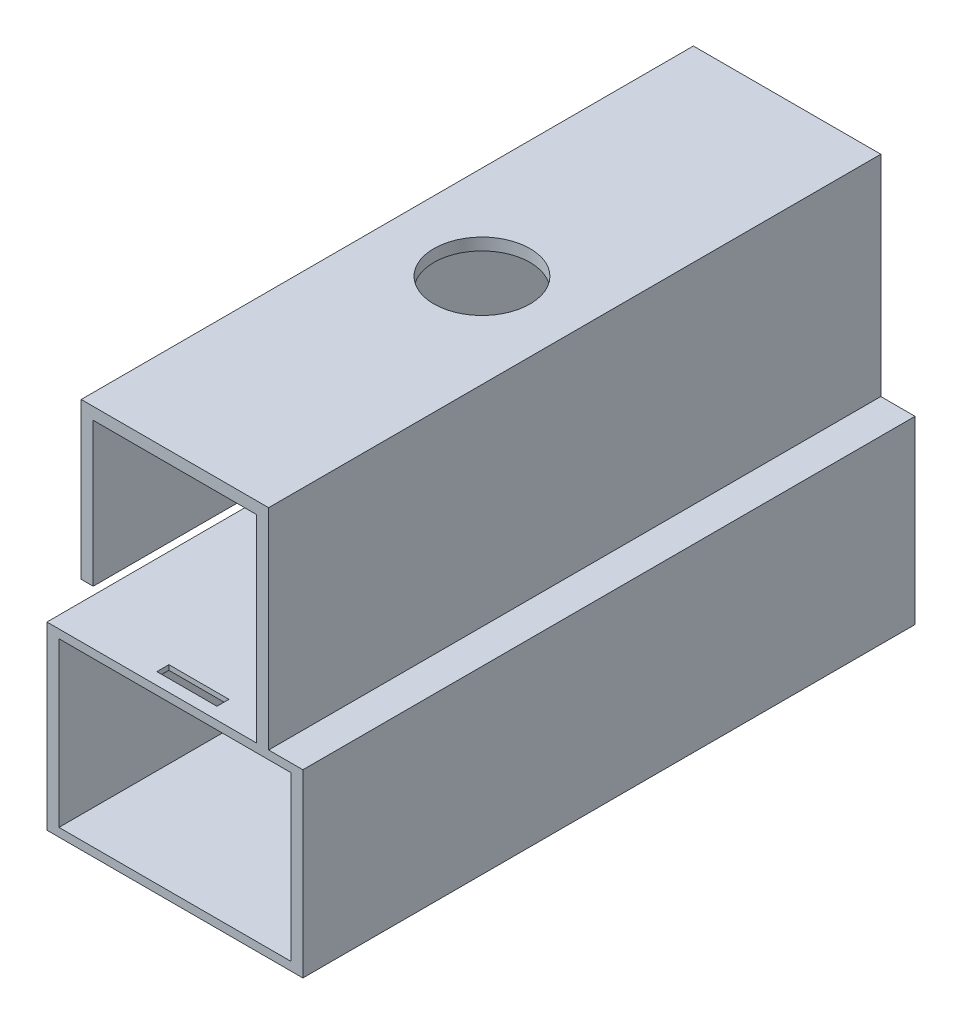
ISO-10303-21;
HEADER;
FILE_DESCRIPTION(('STEP AP214'),'2;1');
FILE_NAME('part.step','',(''),(''),'','','');
FILE_SCHEMA(('AUTOMOTIVE_DESIGN { 1 0 10303 214 1 1 1 1 }'));
ENDSEC;
DATA;
#1=APPLICATION_CONTEXT('core data for automotive mechanical design processes');
#2=APPLICATION_PROTOCOL_DEFINITION('international standard','automotive_design',2000,#1);
#3=PRODUCT_CONTEXT('',#1,'mechanical');
#4=PRODUCT('Part','Part','',(#3));
#5=PRODUCT_RELATED_PRODUCT_CATEGORY('part','',(#4));
#6=PRODUCT_DEFINITION_FORMATION('','',#4);
#7=PRODUCT_DEFINITION_CONTEXT('part definition',#1,'design');
#8=PRODUCT_DEFINITION('design','',#6,#7);
#9=PRODUCT_DEFINITION_SHAPE('','',#8);
#10=(LENGTH_UNIT() NAMED_UNIT(*) SI_UNIT(.MILLI.,.METRE.));
#11=(NAMED_UNIT(*) PLANE_ANGLE_UNIT() SI_UNIT($,.RADIAN.));
#12=(NAMED_UNIT(*) SI_UNIT($,.STERADIAN.) SOLID_ANGLE_UNIT());
#13=UNCERTAINTY_MEASURE_WITH_UNIT(LENGTH_MEASURE(1.E-05),#10,'distance_accuracy_value','');
#14=(GEOMETRIC_REPRESENTATION_CONTEXT(3) GLOBAL_UNCERTAINTY_ASSIGNED_CONTEXT((#13)) GLOBAL_UNIT_ASSIGNED_CONTEXT((#10,
#11,#12)) REPRESENTATION_CONTEXT('',''));
#15=CARTESIAN_POINT('',(0.,0.,0.));
#16=DIRECTION('',(0.,0.,1.));
#17=DIRECTION('',(1.,0.,0.));
#18=AXIS2_PLACEMENT_3D('',#15,#16,#17);
#19=CARTESIAN_POINT('',(-5.,49.9403264248705,97.9));
#20=DIRECTION('',(-1.,0.,0.));
#21=DIRECTION('',(0.,0.,1.));
#22=AXIS2_PLACEMENT_3D('',#19,#20,#21);
#23=PLANE('',#22);
#24=DIRECTION('',(0.,0.,-1.));
#25=VECTOR('',#24,1.);
#26=CARTESIAN_POINT('',(-5.,14.2,99.9));
#27=LINE('',#26,#25);
#28=CARTESIAN_POINT('',(-5.,14.2,99.9));
#29=VERTEX_POINT('',#28);
#30=CARTESIAN_POINT('',(-5.,14.2,97.9));
#31=VERTEX_POINT('',#30);
#32=EDGE_CURVE('E263',#29,#31,#27,.T.);
#33=ORIENTED_EDGE('',*,*,#32,.T.);
#34=DIRECTION('',(0.,-1.,0.));
#35=VECTOR('',#34,1.);
#36=CARTESIAN_POINT('',(-5.,49.9403264248705,97.9));
#37=LINE('',#36,#35);
#38=CARTESIAN_POINT('',(-5.,15.0093264248705,97.9));
#39=VERTEX_POINT('',#38);
#40=EDGE_CURVE('E294',#39,#31,#37,.T.);
#41=ORIENTED_EDGE('',*,*,#40,.F.);
#42=DIRECTION('',(0.,0.,1.));
#43=VECTOR('',#42,1.);
#44=CARTESIAN_POINT('',(-5.,15.0093264248705,97.9));
#45=LINE('',#44,#43);
#46=CARTESIAN_POINT('',(-5.,15.0093264248705,99.9));
#47=VERTEX_POINT('',#46);
#48=EDGE_CURVE('E303',#39,#47,#45,.T.);
#49=ORIENTED_EDGE('',*,*,#48,.T.);
#50=DIRECTION('',(0.,-1.,0.));
#51=VECTOR('',#50,1.);
#52=CARTESIAN_POINT('',(-5.,49.9403264248705,99.9));
#53=LINE('',#52,#51);
#54=EDGE_CURVE('E313',#47,#29,#53,.T.);
#55=ORIENTED_EDGE('',*,*,#54,.T.);
#56=EDGE_LOOP('',(#33,#41,#49,#55));
#57=FACE_BOUND('',#56,.T.);
#58=ADVANCED_FACE('F35',(#57),#23,.F.);
#59=CARTESIAN_POINT('',(5.,49.9403264248705,99.9));
#60=DIRECTION('',(0.,0.,1.));
#61=DIRECTION('',(1.,0.,0.));
#62=AXIS2_PLACEMENT_3D('',#59,#60,#61);
#63=PLANE('',#62);
#64=DIRECTION('',(-1.,0.,0.));
#65=VECTOR('',#64,1.);
#66=CARTESIAN_POINT('',(5.,14.2,99.9));
#67=LINE('',#66,#65);
#68=CARTESIAN_POINT('',(5.,14.2,99.9));
#69=VERTEX_POINT('',#68);
#70=EDGE_CURVE('E260',#69,#29,#67,.T.);
#71=ORIENTED_EDGE('',*,*,#70,.T.);
#72=ORIENTED_EDGE('',*,*,#54,.F.);
#73=DIRECTION('',(1.,0.,0.));
#74=VECTOR('',#73,1.);
#75=CARTESIAN_POINT('',(5.,15.0093264248705,99.9));
#76=LINE('',#75,#74);
#77=CARTESIAN_POINT('',(5.,15.0093264248705,99.9));
#78=VERTEX_POINT('',#77);
#79=EDGE_CURVE('E307',#47,#78,#76,.T.);
#80=ORIENTED_EDGE('',*,*,#79,.T.);
#81=DIRECTION('',(0.,-1.,0.));
#82=VECTOR('',#81,1.);
#83=CARTESIAN_POINT('',(5.,49.9403264248705,99.9));
#84=LINE('',#83,#82);
#85=EDGE_CURVE('E316',#78,#69,#84,.T.);
#86=ORIENTED_EDGE('',*,*,#85,.T.);
#87=EDGE_LOOP('',(#71,#72,#80,#86));
#88=FACE_BOUND('',#87,.T.);
#89=ADVANCED_FACE('F535',(#88),#63,.F.);
#90=CARTESIAN_POINT('',(5.,49.9403264248705,97.9));
#91=DIRECTION('',(1.,0.,0.));
#92=DIRECTION('',(0.,0.,-1.));
#93=AXIS2_PLACEMENT_3D('',#90,#91,#92);
#94=PLANE('',#93);
#95=DIRECTION('',(0.,0.,1.));
#96=VECTOR('',#95,1.);
#97=CARTESIAN_POINT('',(5.,14.2,97.9));
#98=LINE('',#97,#96);
#99=CARTESIAN_POINT('',(5.,14.2,97.9));
#100=VERTEX_POINT('',#99);
#101=EDGE_CURVE('E253',#100,#69,#98,.T.);
#102=ORIENTED_EDGE('',*,*,#101,.T.);
#103=ORIENTED_EDGE('',*,*,#85,.F.);
#104=DIRECTION('',(0.,0.,-1.));
#105=VECTOR('',#104,1.);
#106=CARTESIAN_POINT('',(5.,15.0093264248705,97.9));
#107=LINE('',#106,#105);
#108=CARTESIAN_POINT('',(5.,15.0093264248705,97.9));
#109=VERTEX_POINT('',#108);
#110=EDGE_CURVE('E310',#78,#109,#107,.T.);
#111=ORIENTED_EDGE('',*,*,#110,.T.);
#112=DIRECTION('',(0.,-1.,0.));
#113=VECTOR('',#112,1.);
#114=CARTESIAN_POINT('',(5.,49.9403264248705,97.9));
#115=LINE('',#114,#113);
#116=EDGE_CURVE('E304',#109,#100,#115,.T.);
#117=ORIENTED_EDGE('',*,*,#116,.T.);
#118=EDGE_LOOP('',(#102,#103,#111,#117));
#119=FACE_BOUND('',#118,.T.);
#120=ADVANCED_FACE('F541',(#119),#94,.F.);
#121=CARTESIAN_POINT('',(5.,49.9403264248705,97.9));
#122=DIRECTION('',(0.,0.,-1.));
#123=DIRECTION('',(-1.,0.,0.));
#124=AXIS2_PLACEMENT_3D('',#121,#122,#123);
#125=PLANE('',#124);
#126=DIRECTION('',(1.,0.,0.));
#127=VECTOR('',#126,1.);
#128=CARTESIAN_POINT('',(-5.,14.2,97.9));
#129=LINE('',#128,#127);
#130=EDGE_CURVE('E266',#31,#100,#129,.T.);
#131=ORIENTED_EDGE('',*,*,#130,.T.);
#132=ORIENTED_EDGE('',*,*,#116,.F.);
#133=DIRECTION('',(-1.,0.,0.));
#134=VECTOR('',#133,1.);
#135=CARTESIAN_POINT('',(5.,15.0093264248705,97.9));
#136=LINE('',#135,#134);
#137=EDGE_CURVE('E300',#109,#39,#136,.T.);
#138=ORIENTED_EDGE('',*,*,#137,.T.);
#139=ORIENTED_EDGE('',*,*,#40,.T.);
#140=EDGE_LOOP('',(#131,#132,#138,#139));
#141=FACE_BOUND('',#140,.T.);
#142=ADVANCED_FACE('F532',(#141),#125,.F.);
#143=CARTESIAN_POINT('',(-21.3,15.0093264248705,101.9));
#144=DIRECTION('',(0.,-1.,0.));
#145=DIRECTION('',(0.,0.,-1.));
#146=AXIS2_PLACEMENT_3D('',#143,#144,#145);
#147=PLANE('',#146);
#148=DIRECTION('',(-1.,0.,0.));
#149=VECTOR('',#148,1.);
#150=CARTESIAN_POINT('',(-21.3,15.0093264248705,101.9));
#151=LINE('',#150,#149);
#152=CARTESIAN_POINT('',(13.6,15.0093264248705,101.9));
#153=VERTEX_POINT('',#152);
#154=CARTESIAN_POINT('',(-21.3,15.0093264248705,101.9));
#155=VERTEX_POINT('',#154);
#156=EDGE_CURVE('E446',#153,#155,#151,.T.);
#157=ORIENTED_EDGE('',*,*,#156,.F.);
#158=DIRECTION('',(0.,0.,-1.));
#159=VECTOR('',#158,1.);
#160=CARTESIAN_POINT('',(13.6,15.0093264248705,136.887210520417));
#161=LINE('',#160,#159);
#162=CARTESIAN_POINT('',(13.6,15.0093264248705,12.));
#163=VERTEX_POINT('',#162);
#164=EDGE_CURVE('E341',#153,#163,#161,.T.);
#165=ORIENTED_EDGE('',*,*,#164,.T.);
#166=DIRECTION('',(1.,0.,0.));
#167=VECTOR('',#166,1.);
#168=CARTESIAN_POINT('',(-13.6,15.0093264248705,12.));
#169=LINE('',#168,#167);
#170=CARTESIAN_POINT('',(-13.6,15.0093264248705,12.));
#171=VERTEX_POINT('',#170);
#172=EDGE_CURVE('E404',#171,#163,#169,.T.);
#173=ORIENTED_EDGE('',*,*,#172,.F.);
#174=DIRECTION('',(0.,0.,-1.));
#175=VECTOR('',#174,1.);
#176=CARTESIAN_POINT('',(-13.6,15.0093264248705,136.887210520417));
#177=LINE('',#176,#175);
#178=CARTESIAN_POINT('',(-13.6,15.0093264248705,31.9));
#179=VERTEX_POINT('',#178);
#180=EDGE_CURVE('E352',#179,#171,#177,.T.);
#181=ORIENTED_EDGE('',*,*,#180,.F.);
#182=DIRECTION('',(1.,0.,0.));
#183=VECTOR('',#182,1.);
#184=CARTESIAN_POINT('',(-13.6,15.0093264248705,31.9));
#185=LINE('',#184,#183);
#186=CARTESIAN_POINT('',(-15.6,15.0093264248705,31.9));
#187=VERTEX_POINT('',#186);
#188=EDGE_CURVE('E50',#187,#179,#185,.T.);
#189=ORIENTED_EDGE('',*,*,#188,.F.);
#190=DIRECTION('',(0.,0.,-1.));
#191=VECTOR('',#190,1.);
#192=CARTESIAN_POINT('',(-15.6,15.0093264248705,136.887210520417));
#193=LINE('',#192,#191);
#194=CARTESIAN_POINT('',(-15.6,15.0093264248705,0.));
#195=VERTEX_POINT('',#194);
#196=EDGE_CURVE('E354',#187,#195,#193,.T.);
#197=ORIENTED_EDGE('',*,*,#196,.T.);
#198=DIRECTION('',(-1.,0.,0.));
#199=VECTOR('',#198,1.);
#200=CARTESIAN_POINT('',(-21.3,15.0093264248705,0.));
#201=LINE('',#200,#199);
#202=CARTESIAN_POINT('',(-21.3,15.0093264248705,0.));
#203=VERTEX_POINT('',#202);
#204=EDGE_CURVE('E458',#195,#203,#201,.T.);
#205=ORIENTED_EDGE('',*,*,#204,.T.);
#206=DIRECTION('',(0.,0.,-1.));
#207=VECTOR('',#206,1.);
#208=CARTESIAN_POINT('',(-21.3,15.0093264248705,101.9));
#209=LINE('',#208,#207);
#210=EDGE_CURVE('E43',#155,#203,#209,.T.);
#211=ORIENTED_EDGE('',*,*,#210,.F.);
#212=EDGE_LOOP('',(#157,#165,#173,#181,#189,#197,#205,#211));
#213=FACE_BOUND('',#212,.T.);
#214=ORIENTED_EDGE('',*,*,#79,.F.);
#215=ORIENTED_EDGE('',*,*,#48,.F.);
#216=ORIENTED_EDGE('',*,*,#137,.F.);
#217=ORIENTED_EDGE('',*,*,#110,.F.);
#218=EDGE_LOOP('',(#214,#215,#216,#217));
#219=FACE_BOUND('',#218,.T.);
#220=ADVANCED_FACE('F495',(#213,#219),#147,.F.);
#221=CARTESIAN_POINT('',(21.3,15.0093264248705,0.));
#222=VERTEX_POINT('',#221);
#223=CARTESIAN_POINT('',(15.6,15.0093264248705,0.));
#224=VERTEX_POINT('',#223);
#225=EDGE_CURVE('E459',#222,#224,#201,.T.);
#226=ORIENTED_EDGE('',*,*,#225,.T.);
#227=DIRECTION('',(0.,0.,-1.));
#228=VECTOR('',#227,1.);
#229=CARTESIAN_POINT('',(15.6,15.0093264248705,136.887210520417));
#230=LINE('',#229,#228);
#231=CARTESIAN_POINT('',(15.6,15.0093264248705,101.9));
#232=VERTEX_POINT('',#231);
#233=EDGE_CURVE('E338',#232,#224,#230,.T.);
#234=ORIENTED_EDGE('',*,*,#233,.F.);
#235=CARTESIAN_POINT('',(21.3,15.0093264248705,101.9));
#236=VERTEX_POINT('',#235);
#237=EDGE_CURVE('E448',#236,#232,#151,.T.);
#238=ORIENTED_EDGE('',*,*,#237,.F.);
#239=DIRECTION('',(0.,0.,-1.));
#240=VECTOR('',#239,1.);
#241=CARTESIAN_POINT('',(21.3,15.0093264248705,101.9));
#242=LINE('',#241,#240);
#243=EDGE_CURVE('E11',#236,#222,#242,.T.);
#244=ORIENTED_EDGE('',*,*,#243,.T.);
#245=EDGE_LOOP('',(#226,#234,#238,#244));
#246=FACE_BOUND('',#245,.T.);
#247=ADVANCED_FACE('F525',(#246),#147,.F.);
#248=CARTESIAN_POINT('',(0.,0.,101.9));
#249=DIRECTION('',(0.,0.,1.));
#250=DIRECTION('',(1.,0.,0.));
#251=AXIS2_PLACEMENT_3D('',#248,#249,#250);
#252=PLANE('',#251);
#253=DIRECTION('',(0.,1.,0.));
#254=VECTOR('',#253,1.);
#255=CARTESIAN_POINT('',(13.6,15.0093264248705,101.9));
#256=LINE('',#255,#254);
#257=CARTESIAN_POINT('',(13.6,47.9393264248705,101.9));
#258=VERTEX_POINT('',#257);
#259=EDGE_CURVE('E331',#153,#258,#256,.T.);
#260=ORIENTED_EDGE('',*,*,#259,.F.);
#261=ORIENTED_EDGE('',*,*,#156,.T.);
#262=DIRECTION('',(0.,-1.,0.));
#263=VECTOR('',#262,1.);
#264=CARTESIAN_POINT('',(-21.3,15.0093264248705,101.9));
#265=LINE('',#264,#263);
#266=CARTESIAN_POINT('',(-21.3,-15.0093264248705,101.9));
#267=VERTEX_POINT('',#266);
#268=EDGE_CURVE('E451',#155,#267,#265,.T.);
#269=ORIENTED_EDGE('',*,*,#268,.T.);
#270=DIRECTION('',(1.,0.,0.));
#271=VECTOR('',#270,1.);
#272=CARTESIAN_POINT('',(-21.3,-15.0093264248705,101.9));
#273=LINE('',#272,#271);
#274=CARTESIAN_POINT('',(21.3,-15.0093264248705,101.9));
#275=VERTEX_POINT('',#274);
#276=EDGE_CURVE('E453',#267,#275,#273,.T.);
#277=ORIENTED_EDGE('',*,*,#276,.T.);
#278=DIRECTION('',(0.,1.,0.));
#279=VECTOR('',#278,1.);
#280=CARTESIAN_POINT('',(21.3,15.0093264248705,101.9));
#281=LINE('',#280,#279);
#282=EDGE_CURVE('E443',#275,#236,#281,.T.);
#283=ORIENTED_EDGE('',*,*,#282,.T.);
#284=ORIENTED_EDGE('',*,*,#237,.T.);
#285=DIRECTION('',(0.,-1.,0.));
#286=VECTOR('',#285,1.);
#287=CARTESIAN_POINT('',(15.6,49.9393264248705,101.9));
#288=LINE('',#287,#286);
#289=CARTESIAN_POINT('',(15.6,49.9393264248705,101.9));
#290=VERTEX_POINT('',#289);
#291=EDGE_CURVE('E335',#290,#232,#288,.T.);
#292=ORIENTED_EDGE('',*,*,#291,.F.);
#293=DIRECTION('',(1.,0.,0.));
#294=VECTOR('',#293,1.);
#295=CARTESIAN_POINT('',(-13.6,49.9393264248705,101.9));
#296=LINE('',#295,#294);
#297=CARTESIAN_POINT('',(-15.6,49.9393264248705,101.9));
#298=VERTEX_POINT('',#297);
#299=EDGE_CURVE('E400',#298,#290,#296,.T.);
#300=ORIENTED_EDGE('',*,*,#299,.F.);
#301=DIRECTION('',(0.,1.,0.));
#302=VECTOR('',#301,1.);
#303=CARTESIAN_POINT('',(-15.6,49.9393264248705,101.9));
#304=LINE('',#303,#302);
#305=CARTESIAN_POINT('',(-15.6,24.0093264248705,101.9));
#306=VERTEX_POINT('',#305);
#307=EDGE_CURVE('E348',#306,#298,#304,.T.);
#308=ORIENTED_EDGE('',*,*,#307,.F.);
#309=DIRECTION('',(-1.,0.,0.));
#310=VECTOR('',#309,1.);
#311=CARTESIAN_POINT('',(-15.6,24.0093264248705,101.9));
#312=LINE('',#311,#310);
#313=CARTESIAN_POINT('',(-13.6,24.0093264248705,101.9));
#314=VERTEX_POINT('',#313);
#315=EDGE_CURVE('E246',#314,#306,#312,.T.);
#316=ORIENTED_EDGE('',*,*,#315,.F.);
#317=DIRECTION('',(0.,-1.,0.));
#318=VECTOR('',#317,1.);
#319=CARTESIAN_POINT('',(-13.6,15.0093264248705,101.9));
#320=LINE('',#319,#318);
#321=CARTESIAN_POINT('',(-13.6,47.9393264248705,101.9));
#322=VERTEX_POINT('',#321);
#323=EDGE_CURVE('E251',#322,#314,#320,.T.);
#324=ORIENTED_EDGE('',*,*,#323,.F.);
#325=DIRECTION('',(1.,0.,0.));
#326=VECTOR('',#325,1.);
#327=CARTESIAN_POINT('',(-13.6,47.9393264248705,101.9));
#328=LINE('',#327,#326);
#329=EDGE_CURVE('E398',#322,#258,#328,.T.);
#330=ORIENTED_EDGE('',*,*,#329,.T.);
#331=EDGE_LOOP('',(#260,#261,#269,#277,#283,#284,#292,#300,#308,#316,#324,#330));
#332=FACE_BOUND('',#331,.T.);
#333=DIRECTION('',(-1.,0.,0.));
#334=VECTOR('',#333,1.);
#335=CARTESIAN_POINT('',(-19.3,13.6,101.9));
#336=LINE('',#335,#334);
#337=CARTESIAN_POINT('',(19.3,13.6,101.9));
#338=VERTEX_POINT('',#337);
#339=CARTESIAN_POINT('',(-19.3,13.6,101.9));
#340=VERTEX_POINT('',#339);
#341=EDGE_CURVE('E414',#338,#340,#336,.T.);
#342=ORIENTED_EDGE('',*,*,#341,.F.);
#343=DIRECTION('',(0.,1.,0.));
#344=VECTOR('',#343,1.);
#345=CARTESIAN_POINT('',(19.3,13.6,101.9));
#346=LINE('',#345,#344);
#347=CARTESIAN_POINT('',(19.3,-13.6,101.9));
#348=VERTEX_POINT('',#347);
#349=EDGE_CURVE('E412',#348,#338,#346,.T.);
#350=ORIENTED_EDGE('',*,*,#349,.F.);
#351=DIRECTION('',(1.,0.,0.));
#352=VECTOR('',#351,1.);
#353=CARTESIAN_POINT('',(-19.3,-13.6,101.9));
#354=LINE('',#353,#352);
#355=CARTESIAN_POINT('',(-19.3,-13.6,101.9));
#356=VERTEX_POINT('',#355);
#357=EDGE_CURVE('E420',#356,#348,#354,.T.);
#358=ORIENTED_EDGE('',*,*,#357,.F.);
#359=DIRECTION('',(0.,-1.,0.));
#360=VECTOR('',#359,1.);
#361=CARTESIAN_POINT('',(-19.3,13.6,101.9));
#362=LINE('',#361,#360);
#363=EDGE_CURVE('E417',#340,#356,#362,.T.);
#364=ORIENTED_EDGE('',*,*,#363,.F.);
#365=EDGE_LOOP('',(#342,#350,#358,#364));
#366=FACE_BOUND('',#365,.T.);
#367=ADVANCED_FACE('F491',(#332,#366),#252,.T.);
#368=CARTESIAN_POINT('',(0.,0.,0.));
#369=DIRECTION('',(0.,0.,1.));
#370=DIRECTION('',(1.,0.,0.));
#371=AXIS2_PLACEMENT_3D('',#368,#369,#370);
#372=PLANE('',#371);
#373=ORIENTED_EDGE('',*,*,#204,.F.);
#374=DIRECTION('',(0.,1.,0.));
#375=VECTOR('',#374,1.);
#376=CARTESIAN_POINT('',(-15.6,49.9393264248705,0.));
#377=LINE('',#376,#375);
#378=CARTESIAN_POINT('',(-15.6,49.9393264248705,0.));
#379=VERTEX_POINT('',#378);
#380=EDGE_CURVE('E345',#195,#379,#377,.T.);
#381=ORIENTED_EDGE('',*,*,#380,.T.);
#382=DIRECTION('',(1.,0.,0.));
#383=VECTOR('',#382,1.);
#384=CARTESIAN_POINT('',(-13.6,49.9393264248705,0.));
#385=LINE('',#384,#383);
#386=CARTESIAN_POINT('',(15.6,49.9393264248705,0.));
#387=VERTEX_POINT('',#386);
#388=EDGE_CURVE('E402',#379,#387,#385,.T.);
#389=ORIENTED_EDGE('',*,*,#388,.T.);
#390=DIRECTION('',(0.,-1.,0.));
#391=VECTOR('',#390,1.);
#392=CARTESIAN_POINT('',(15.6,49.9393264248705,0.));
#393=LINE('',#392,#391);
#394=EDGE_CURVE('E328',#387,#224,#393,.T.);
#395=ORIENTED_EDGE('',*,*,#394,.T.);
#396=ORIENTED_EDGE('',*,*,#225,.F.);
#397=DIRECTION('',(0.,1.,0.));
#398=VECTOR('',#397,1.);
#399=CARTESIAN_POINT('',(21.3,15.0093264248705,0.));
#400=LINE('',#399,#398);
#401=CARTESIAN_POINT('',(21.3,-15.0093264248705,0.));
#402=VERTEX_POINT('',#401);
#403=EDGE_CURVE('E442',#402,#222,#400,.T.);
#404=ORIENTED_EDGE('',*,*,#403,.F.);
#405=DIRECTION('',(1.,0.,0.));
#406=VECTOR('',#405,1.);
#407=CARTESIAN_POINT('',(-21.3,-15.0093264248705,0.));
#408=LINE('',#407,#406);
#409=CARTESIAN_POINT('',(-21.3,-15.0093264248705,0.));
#410=VERTEX_POINT('',#409);
#411=EDGE_CURVE('E447',#410,#402,#408,.T.);
#412=ORIENTED_EDGE('',*,*,#411,.F.);
#413=DIRECTION('',(0.,-1.,0.));
#414=VECTOR('',#413,1.);
#415=CARTESIAN_POINT('',(-21.3,15.0093264248705,0.));
#416=LINE('',#415,#414);
#417=EDGE_CURVE('E461',#203,#410,#416,.T.);
#418=ORIENTED_EDGE('',*,*,#417,.F.);
#419=EDGE_LOOP('',(#373,#381,#389,#395,#396,#404,#412,#418));
#420=FACE_BOUND('',#419,.T.);
#421=DIRECTION('',(0.,1.,0.));
#422=VECTOR('',#421,1.);
#423=CARTESIAN_POINT('',(19.3,13.6,0.));
#424=LINE('',#423,#422);
#425=CARTESIAN_POINT('',(19.3,-13.6,0.));
#426=VERTEX_POINT('',#425);
#427=CARTESIAN_POINT('',(19.3,13.6,0.));
#428=VERTEX_POINT('',#427);
#429=EDGE_CURVE('E395',#426,#428,#424,.T.);
#430=ORIENTED_EDGE('',*,*,#429,.T.);
#431=DIRECTION('',(-1.,0.,0.));
#432=VECTOR('',#431,1.);
#433=CARTESIAN_POINT('',(-19.3,13.6,0.));
#434=LINE('',#433,#432);
#435=CARTESIAN_POINT('',(-19.3,13.6,0.));
#436=VERTEX_POINT('',#435);
#437=EDGE_CURVE('E425',#428,#436,#434,.T.);
#438=ORIENTED_EDGE('',*,*,#437,.T.);
#439=DIRECTION('',(0.,-1.,0.));
#440=VECTOR('',#439,1.);
#441=CARTESIAN_POINT('',(-19.3,13.6,0.));
#442=LINE('',#441,#440);
#443=CARTESIAN_POINT('',(-19.3,-13.6,0.));
#444=VERTEX_POINT('',#443);
#445=EDGE_CURVE('E428',#436,#444,#442,.T.);
#446=ORIENTED_EDGE('',*,*,#445,.T.);
#447=DIRECTION('',(1.,0.,0.));
#448=VECTOR('',#447,1.);
#449=CARTESIAN_POINT('',(-19.3,-13.6,0.));
#450=LINE('',#449,#448);
#451=EDGE_CURVE('E415',#444,#426,#450,.T.);
#452=ORIENTED_EDGE('',*,*,#451,.T.);
#453=EDGE_LOOP('',(#430,#438,#446,#452));
#454=FACE_BOUND('',#453,.T.);
#455=ADVANCED_FACE('F479',(#420,#454),#372,.F.);
#456=CARTESIAN_POINT('',(21.3,15.0093264248705,101.9));
#457=DIRECTION('',(-1.,0.,0.));
#458=DIRECTION('',(0.,0.,1.));
#459=AXIS2_PLACEMENT_3D('',#456,#457,#458);
#460=PLANE('',#459);
#461=ORIENTED_EDGE('',*,*,#403,.T.);
#462=ORIENTED_EDGE('',*,*,#243,.F.);
#463=ORIENTED_EDGE('',*,*,#282,.F.);
#464=DIRECTION('',(0.,0.,-1.));
#465=VECTOR('',#464,1.);
#466=CARTESIAN_POINT('',(21.3,-15.0093264248705,101.9));
#467=LINE('',#466,#465);
#468=EDGE_CURVE('E455',#275,#402,#467,.T.);
#469=ORIENTED_EDGE('',*,*,#468,.T.);
#470=EDGE_LOOP('',(#461,#462,#463,#469));
#471=FACE_BOUND('',#470,.T.);
#472=ADVANCED_FACE('F37',(#471),#460,.F.);
#473=CARTESIAN_POINT('',(-21.3,15.0093264248705,101.9));
#474=DIRECTION('',(1.,0.,0.));
#475=DIRECTION('',(0.,0.,-1.));
#476=AXIS2_PLACEMENT_3D('',#473,#474,#475);
#477=PLANE('',#476);
#478=ORIENTED_EDGE('',*,*,#417,.T.);
#479=DIRECTION('',(0.,0.,-1.));
#480=VECTOR('',#479,1.);
#481=CARTESIAN_POINT('',(-21.3,-15.0093264248705,101.9));
#482=LINE('',#481,#480);
#483=EDGE_CURVE('E466',#267,#410,#482,.T.);
#484=ORIENTED_EDGE('',*,*,#483,.F.);
#485=ORIENTED_EDGE('',*,*,#268,.F.);
#486=ORIENTED_EDGE('',*,*,#210,.T.);
#487=EDGE_LOOP('',(#478,#484,#485,#486));
#488=FACE_BOUND('',#487,.T.);
#489=ADVANCED_FACE('F473',(#488),#477,.F.);
#490=CARTESIAN_POINT('',(-21.3,-15.0093264248705,101.9));
#491=DIRECTION('',(0.,1.,0.));
#492=DIRECTION('',(0.,0.,1.));
#493=AXIS2_PLACEMENT_3D('',#490,#491,#492);
#494=PLANE('',#493);
#495=ORIENTED_EDGE('',*,*,#411,.T.);
#496=ORIENTED_EDGE('',*,*,#468,.F.);
#497=ORIENTED_EDGE('',*,*,#276,.F.);
#498=ORIENTED_EDGE('',*,*,#483,.T.);
#499=EDGE_LOOP('',(#495,#496,#497,#498));
#500=FACE_BOUND('',#499,.T.);
#501=ADVANCED_FACE('F484',(#500),#494,.F.);
#502=CARTESIAN_POINT('',(19.3,13.6,101.9));
#503=DIRECTION('',(-1.,0.,0.));
#504=DIRECTION('',(0.,0.,1.));
#505=AXIS2_PLACEMENT_3D('',#502,#503,#504);
#506=PLANE('',#505);
#507=ORIENTED_EDGE('',*,*,#429,.F.);
#508=DIRECTION('',(0.,0.,-1.));
#509=VECTOR('',#508,1.);
#510=CARTESIAN_POINT('',(19.3,-13.6,101.9));
#511=LINE('',#510,#509);
#512=EDGE_CURVE('E422',#348,#426,#511,.T.);
#513=ORIENTED_EDGE('',*,*,#512,.F.);
#514=ORIENTED_EDGE('',*,*,#349,.T.);
#515=DIRECTION('',(0.,0.,-1.));
#516=VECTOR('',#515,1.);
#517=CARTESIAN_POINT('',(19.3,13.6,101.9));
#518=LINE('',#517,#516);
#519=EDGE_CURVE('E439',#338,#428,#518,.T.);
#520=ORIENTED_EDGE('',*,*,#519,.T.);
#521=EDGE_LOOP('',(#507,#513,#514,#520));
#522=FACE_BOUND('',#521,.T.);
#523=ADVANCED_FACE('F593',(#522),#506,.T.);
#524=CARTESIAN_POINT('',(-19.3,13.6,101.9));
#525=DIRECTION('',(0.,-1.,0.));
#526=DIRECTION('',(0.,0.,-1.));
#527=AXIS2_PLACEMENT_3D('',#524,#525,#526);
#528=PLANE('',#527);
#529=DIRECTION('',(0.,0.,-1.));
#530=VECTOR('',#529,1.);
#531=CARTESIAN_POINT('',(-6.,13.6,100.9));
#532=LINE('',#531,#530);
#533=CARTESIAN_POINT('',(-6.,13.6,100.9));
#534=VERTEX_POINT('',#533);
#535=CARTESIAN_POINT('',(-6.,13.6,96.9));
#536=VERTEX_POINT('',#535);
#537=EDGE_CURVE('E58',#534,#536,#532,.T.);
#538=ORIENTED_EDGE('',*,*,#537,.F.);
#539=DIRECTION('',(-1.,0.,0.));
#540=VECTOR('',#539,1.);
#541=CARTESIAN_POINT('',(6.,13.6,100.9));
#542=LINE('',#541,#540);
#543=CARTESIAN_POINT('',(6.,13.6,100.9));
#544=VERTEX_POINT('',#543);
#545=EDGE_CURVE('E273',#544,#534,#542,.T.);
#546=ORIENTED_EDGE('',*,*,#545,.F.);
#547=DIRECTION('',(0.,0.,1.));
#548=VECTOR('',#547,1.);
#549=CARTESIAN_POINT('',(6.,13.6,96.9));
#550=LINE('',#549,#548);
#551=CARTESIAN_POINT('',(6.,13.6,96.9));
#552=VERTEX_POINT('',#551);
#553=EDGE_CURVE('E287',#552,#544,#550,.T.);
#554=ORIENTED_EDGE('',*,*,#553,.F.);
#555=DIRECTION('',(1.,0.,0.));
#556=VECTOR('',#555,1.);
#557=CARTESIAN_POINT('',(-6.,13.6,96.9));
#558=LINE('',#557,#556);
#559=EDGE_CURVE('E284',#536,#552,#558,.T.);
#560=ORIENTED_EDGE('',*,*,#559,.F.);
#561=EDGE_LOOP('',(#538,#546,#554,#560));
#562=FACE_BOUND('',#561,.T.);
#563=ORIENTED_EDGE('',*,*,#437,.F.);
#564=ORIENTED_EDGE('',*,*,#519,.F.);
#565=ORIENTED_EDGE('',*,*,#341,.T.);
#566=DIRECTION('',(0.,0.,-1.));
#567=VECTOR('',#566,1.);
#568=CARTESIAN_POINT('',(-19.3,13.6,101.9));
#569=LINE('',#568,#567);
#570=EDGE_CURVE('E437',#340,#436,#569,.T.);
#571=ORIENTED_EDGE('',*,*,#570,.T.);
#572=EDGE_LOOP('',(#563,#564,#565,#571));
#573=FACE_BOUND('',#572,.T.);
#574=ADVANCED_FACE('F589',(#562,#573),#528,.T.);
#575=CARTESIAN_POINT('',(-19.3,13.6,101.9));
#576=DIRECTION('',(1.,0.,0.));
#577=DIRECTION('',(0.,0.,-1.));
#578=AXIS2_PLACEMENT_3D('',#575,#576,#577);
#579=PLANE('',#578);
#580=ORIENTED_EDGE('',*,*,#445,.F.);
#581=ORIENTED_EDGE('',*,*,#570,.F.);
#582=ORIENTED_EDGE('',*,*,#363,.T.);
#583=DIRECTION('',(0.,0.,-1.));
#584=VECTOR('',#583,1.);
#585=CARTESIAN_POINT('',(-19.3,-13.6,101.9));
#586=LINE('',#585,#584);
#587=EDGE_CURVE('E435',#356,#444,#586,.T.);
#588=ORIENTED_EDGE('',*,*,#587,.T.);
#589=EDGE_LOOP('',(#580,#581,#582,#588));
#590=FACE_BOUND('',#589,.T.);
#591=ADVANCED_FACE('F585',(#590),#579,.T.);
#592=CARTESIAN_POINT('',(-19.3,-13.6,101.9));
#593=DIRECTION('',(0.,1.,0.));
#594=DIRECTION('',(0.,0.,1.));
#595=AXIS2_PLACEMENT_3D('',#592,#593,#594);
#596=PLANE('',#595);
#597=ORIENTED_EDGE('',*,*,#451,.F.);
#598=ORIENTED_EDGE('',*,*,#587,.F.);
#599=ORIENTED_EDGE('',*,*,#357,.T.);
#600=ORIENTED_EDGE('',*,*,#512,.T.);
#601=EDGE_LOOP('',(#597,#598,#599,#600));
#602=FACE_BOUND('',#601,.T.);
#603=ADVANCED_FACE('F581',(#602),#596,.T.);
#604=CARTESIAN_POINT('',(-13.6,45.6407493816716,8.));
#605=DIRECTION('',(1.,0.,0.));
#606=DIRECTION('',(0.,0.,-1.));
#607=AXIS2_PLACEMENT_3D('',#604,#605,#606);
#608=CYLINDRICAL_SURFACE('',#607,4.);
#609=DIRECTION('',(1.,0.,0.));
#610=VECTOR('',#609,1.);
#611=CARTESIAN_POINT('',(-13.6,41.8581728103541,9.30081300813008));
#612=LINE('',#611,#610);
#613=CARTESIAN_POINT('',(-13.6,41.8581728103541,9.30081300813008));
#614=VERTEX_POINT('',#613);
#615=CARTESIAN_POINT('',(13.6,41.8581728103541,9.30081300813008));
#616=VERTEX_POINT('',#615);
#617=EDGE_CURVE('E392',#614,#616,#612,.T.);
#618=ORIENTED_EDGE('',*,*,#617,.T.);
#619=CARTESIAN_POINT('',(13.6,45.6407493816716,8.));
#620=DIRECTION('',(1.,0.,0.));
#621=DIRECTION('',(0.,0.,-1.));
#622=AXIS2_PLACEMENT_3D('',#619,#620,#621);
#623=CIRCLE('',#622,4.);
#624=CARTESIAN_POINT('',(13.6,45.6407493816716,12.));
#625=VERTEX_POINT('',#624);
#626=EDGE_CURVE('E358',#616,#625,#623,.F.);
#627=ORIENTED_EDGE('',*,*,#626,.T.);
#628=DIRECTION('',(1.,0.,0.));
#629=VECTOR('',#628,1.);
#630=CARTESIAN_POINT('',(-13.6,45.6407493816716,12.));
#631=LINE('',#630,#629);
#632=CARTESIAN_POINT('',(-13.6,45.6407493816716,12.));
#633=VERTEX_POINT('',#632);
#634=EDGE_CURVE('E393',#633,#625,#631,.T.);
#635=ORIENTED_EDGE('',*,*,#634,.F.);
#636=CARTESIAN_POINT('',(-13.6,45.6407493816716,8.));
#637=DIRECTION('',(1.,0.,0.));
#638=DIRECTION('',(0.,0.,-1.));
#639=AXIS2_PLACEMENT_3D('',#636,#637,#638);
#640=CIRCLE('',#639,4.);
#641=EDGE_CURVE('E376',#614,#633,#640,.F.);
#642=ORIENTED_EDGE('',*,*,#641,.F.);
#643=EDGE_LOOP('',(#618,#627,#635,#642));
#644=FACE_BOUND('',#643,.T.);
#645=ADVANCED_FACE('F564',(#644),#608,.T.);
#646=CARTESIAN_POINT('',(-13.6,0.,12.));
#647=DIRECTION('',(0.,0.,1.));
#648=DIRECTION('',(1.,0.,0.));
#649=AXIS2_PLACEMENT_3D('',#646,#647,#648);
#650=PLANE('',#649);
#651=ORIENTED_EDGE('',*,*,#634,.T.);
#652=DIRECTION('',(0.,-1.,0.));
#653=VECTOR('',#652,1.);
#654=CARTESIAN_POINT('',(13.6,0.,12.));
#655=LINE('',#654,#653);
#656=CARTESIAN_POINT('',(13.6,47.9393264248705,12.));
#657=VERTEX_POINT('',#656);
#658=EDGE_CURVE('E373',#657,#625,#655,.T.);
#659=ORIENTED_EDGE('',*,*,#658,.F.);
#660=DIRECTION('',(1.,0.,0.));
#661=VECTOR('',#660,1.);
#662=CARTESIAN_POINT('',(-13.6,47.9393264248705,12.));
#663=LINE('',#662,#661);
#664=CARTESIAN_POINT('',(-13.6,47.9393264248705,12.));
#665=VERTEX_POINT('',#664);
#666=EDGE_CURVE('E396',#665,#657,#663,.T.);
#667=ORIENTED_EDGE('',*,*,#666,.F.);
#668=DIRECTION('',(0.,-1.,0.));
#669=VECTOR('',#668,1.);
#670=CARTESIAN_POINT('',(-13.6,0.,12.));
#671=LINE('',#670,#669);
#672=EDGE_CURVE('E389',#665,#633,#671,.T.);
#673=ORIENTED_EDGE('',*,*,#672,.T.);
#674=EDGE_LOOP('',(#651,#659,#667,#673));
#675=FACE_BOUND('',#674,.T.);
#676=ADVANCED_FACE('F560',(#675),#650,.T.);
#677=CARTESIAN_POINT('',(-13.6,47.9393264248705,0.));
#678=DIRECTION('',(0.,-1.,0.));
#679=DIRECTION('',(0.,0.,-1.));
#680=AXIS2_PLACEMENT_3D('',#677,#678,#679);
#681=PLANE('',#680);
#682=CARTESIAN_POINT('',(0.,47.9393264248705,50.7883495145631));
#683=DIRECTION('',(0.,-1.,0.));
#684=DIRECTION('',(0.,0.,-1.));
#685=AXIS2_PLACEMENT_3D('',#682,#683,#684);
#686=CIRCLE('',#685,8.);
#687=CARTESIAN_POINT('',(0.,47.9393264248705,42.7883495145631));
#688=VERTEX_POINT('',#687);
#689=EDGE_CURVE('E325',#688,#688,#686,.F.);
#690=ORIENTED_EDGE('',*,*,#689,.T.);
#691=EDGE_LOOP('',(#690));
#692=FACE_BOUND('',#691,.T.);
#693=ORIENTED_EDGE('',*,*,#666,.T.);
#694=DIRECTION('',(0.,0.,-1.));
#695=VECTOR('',#694,1.);
#696=CARTESIAN_POINT('',(13.6,47.9393264248705,0.));
#697=LINE('',#696,#695);
#698=EDGE_CURVE('E370',#258,#657,#697,.T.);
#699=ORIENTED_EDGE('',*,*,#698,.F.);
#700=ORIENTED_EDGE('',*,*,#329,.F.);
#701=DIRECTION('',(0.,0.,-1.));
#702=VECTOR('',#701,1.);
#703=CARTESIAN_POINT('',(-13.6,47.9393264248705,0.));
#704=LINE('',#703,#702);
#705=EDGE_CURVE('E386',#322,#665,#704,.T.);
#706=ORIENTED_EDGE('',*,*,#705,.T.);
#707=EDGE_LOOP('',(#693,#699,#700,#706));
#708=FACE_BOUND('',#707,.T.);
#709=ADVANCED_FACE('F563',(#692,#708),#681,.T.);
#710=CARTESIAN_POINT('',(-13.6,49.9393264248705,0.));
#711=DIRECTION('',(0.,1.,0.));
#712=DIRECTION('',(0.,0.,1.));
#713=AXIS2_PLACEMENT_3D('',#710,#711,#712);
#714=PLANE('',#713);
#715=CARTESIAN_POINT('',(0.,49.9393264248705,50.7883495145631));
#716=DIRECTION('',(0.,1.,0.));
#717=DIRECTION('',(0.,0.,1.));
#718=AXIS2_PLACEMENT_3D('',#715,#716,#717);
#719=CIRCLE('',#718,8.);
#720=CARTESIAN_POINT('',(0.,49.9393264248705,58.7883495145631));
#721=VERTEX_POINT('',#720);
#722=EDGE_CURVE('E312',#721,#721,#719,.T.);
#723=ORIENTED_EDGE('',*,*,#722,.F.);
#724=EDGE_LOOP('',(#723));
#725=FACE_BOUND('',#724,.T.);
#726=ORIENTED_EDGE('',*,*,#299,.T.);
#727=DIRECTION('',(0.,0.,-1.));
#728=VECTOR('',#727,1.);
#729=CARTESIAN_POINT('',(15.6,49.9393264248705,136.887210520417));
#730=LINE('',#729,#728);
#731=EDGE_CURVE('E334',#290,#387,#730,.T.);
#732=ORIENTED_EDGE('',*,*,#731,.T.);
#733=ORIENTED_EDGE('',*,*,#388,.F.);
#734=DIRECTION('',(0.,0.,-1.));
#735=VECTOR('',#734,1.);
#736=CARTESIAN_POINT('',(-15.6,49.9393264248705,136.887210520417));
#737=LINE('',#736,#735);
#738=EDGE_CURVE('E350',#298,#379,#737,.T.);
#739=ORIENTED_EDGE('',*,*,#738,.F.);
#740=EDGE_LOOP('',(#726,#732,#733,#739));
#741=FACE_BOUND('',#740,.T.);
#742=ADVANCED_FACE('F520',(#725,#741),#714,.T.);
#743=CARTESIAN_POINT('',(-13.6,0.,12.));
#744=DIRECTION('',(0.,0.,1.));
#745=DIRECTION('',(0.,-1.,0.));
#746=AXIS2_PLACEMENT_3D('',#743,#744,#745);
#747=PLANE('',#746);
#748=ORIENTED_EDGE('',*,*,#172,.T.);
#749=DIRECTION('',(0.,-1.,0.));
#750=VECTOR('',#749,1.);
#751=CARTESIAN_POINT('',(13.6,0.,12.));
#752=LINE('',#751,#750);
#753=CARTESIAN_POINT('',(13.6,23.9053668049987,12.));
#754=VERTEX_POINT('',#753);
#755=EDGE_CURVE('E367',#754,#163,#752,.T.);
#756=ORIENTED_EDGE('',*,*,#755,.F.);
#757=DIRECTION('',(1.,0.,0.));
#758=VECTOR('',#757,1.);
#759=CARTESIAN_POINT('',(-13.6,23.9053668049987,12.));
#760=LINE('',#759,#758);
#761=CARTESIAN_POINT('',(-13.6,23.9053668049987,12.));
#762=VERTEX_POINT('',#761);
#763=EDGE_CURVE('E407',#762,#754,#760,.T.);
#764=ORIENTED_EDGE('',*,*,#763,.F.);
#765=DIRECTION('',(0.,-1.,0.));
#766=VECTOR('',#765,1.);
#767=CARTESIAN_POINT('',(-13.6,0.,12.));
#768=LINE('',#767,#766);
#769=EDGE_CURVE('E383',#762,#171,#768,.T.);
#770=ORIENTED_EDGE('',*,*,#769,.T.);
#771=EDGE_LOOP('',(#748,#756,#764,#770));
#772=FACE_BOUND('',#771,.T.);
#773=ADVANCED_FACE('F501',(#772),#747,.T.);
#774=CARTESIAN_POINT('',(-13.6,23.9053668049987,10.));
#775=DIRECTION('',(1.,0.,0.));
#776=DIRECTION('',(0.,0.,-1.));
#777=AXIS2_PLACEMENT_3D('',#774,#775,#776);
#778=CYLINDRICAL_SURFACE('',#777,2.);
#779=ORIENTED_EDGE('',*,*,#763,.T.);
#780=CARTESIAN_POINT('',(13.6,23.9053668049987,10.));
#781=DIRECTION('',(1.,0.,0.));
#782=DIRECTION('',(0.,0.,-1.));
#783=AXIS2_PLACEMENT_3D('',#780,#781,#782);
#784=CIRCLE('',#783,2.);
#785=CARTESIAN_POINT('',(13.6,25.8673007117699,10.3883495145631));
#786=VERTEX_POINT('',#785);
#787=EDGE_CURVE('E364',#786,#754,#784,.T.);
#788=ORIENTED_EDGE('',*,*,#787,.F.);
#789=DIRECTION('',(1.,0.,0.));
#790=VECTOR('',#789,1.);
#791=CARTESIAN_POINT('',(-13.6,25.8673007117699,10.3883495145631));
#792=LINE('',#791,#790);
#793=CARTESIAN_POINT('',(-13.6,25.8673007117699,10.3883495145631));
#794=VERTEX_POINT('',#793);
#795=EDGE_CURVE('E409',#794,#786,#792,.T.);
#796=ORIENTED_EDGE('',*,*,#795,.F.);
#797=CARTESIAN_POINT('',(-13.6,23.9053668049987,10.));
#798=DIRECTION('',(1.,0.,0.));
#799=DIRECTION('',(0.,0.,-1.));
#800=AXIS2_PLACEMENT_3D('',#797,#798,#799);
#801=CIRCLE('',#800,2.);
#802=EDGE_CURVE('E380',#794,#762,#801,.T.);
#803=ORIENTED_EDGE('',*,*,#802,.T.);
#804=EDGE_LOOP('',(#779,#788,#796,#803));
#805=FACE_BOUND('',#804,.T.);
#806=ADVANCED_FACE('F509',(#805),#778,.T.);
#807=CARTESIAN_POINT('',(-13.6,34.0093264248705,12.));
#808=DIRECTION('',(1.,0.,0.));
#809=DIRECTION('',(0.,0.,-1.));
#810=AXIS2_PLACEMENT_3D('',#807,#808,#809);
#811=CYLINDRICAL_SURFACE('',#810,8.3);
#812=ORIENTED_EDGE('',*,*,#795,.T.);
#813=CARTESIAN_POINT('',(13.6,34.0093264248705,12.));
#814=DIRECTION('',(1.,0.,0.));
#815=DIRECTION('',(0.,0.,-1.));
#816=AXIS2_PLACEMENT_3D('',#813,#814,#815);
#817=CIRCLE('',#816,8.3);
#818=EDGE_CURVE('E361',#786,#616,#817,.T.);
#819=ORIENTED_EDGE('',*,*,#818,.T.);
#820=ORIENTED_EDGE('',*,*,#617,.F.);
#821=CARTESIAN_POINT('',(-13.6,34.0093264248705,12.));
#822=DIRECTION('',(1.,0.,0.));
#823=DIRECTION('',(0.,0.,-1.));
#824=AXIS2_PLACEMENT_3D('',#821,#822,#823);
#825=CIRCLE('',#824,8.3);
#826=EDGE_CURVE('E378',#794,#614,#825,.T.);
#827=ORIENTED_EDGE('',*,*,#826,.F.);
#828=EDGE_LOOP('',(#812,#819,#820,#827));
#829=FACE_BOUND('',#828,.T.);
#830=ADVANCED_FACE('F559',(#829),#811,.F.);
#831=CARTESIAN_POINT('',(-15.6,49.9393264248705,136.887210520417));
#832=DIRECTION('',(-1.,0.,0.));
#833=DIRECTION('',(0.,-1.,0.));
#834=AXIS2_PLACEMENT_3D('',#831,#832,#833);
#835=PLANE('',#834);
#836=DIRECTION('',(0.,0.,1.));
#837=VECTOR('',#836,1.);
#838=CARTESIAN_POINT('',(-15.6,24.0093264248705,31.9));
#839=LINE('',#838,#837);
#840=CARTESIAN_POINT('',(-15.6,24.0093264248705,31.9));
#841=VERTEX_POINT('',#840);
#842=EDGE_CURVE('E238',#841,#306,#839,.T.);
#843=ORIENTED_EDGE('',*,*,#842,.T.);
#844=ORIENTED_EDGE('',*,*,#307,.T.);
#845=ORIENTED_EDGE('',*,*,#738,.T.);
#846=ORIENTED_EDGE('',*,*,#380,.F.);
#847=ORIENTED_EDGE('',*,*,#196,.F.);
#848=DIRECTION('',(0.,-1.,0.));
#849=VECTOR('',#848,1.);
#850=CARTESIAN_POINT('',(-15.6,15.0093264248705,31.9));
#851=LINE('',#850,#849);
#852=EDGE_CURVE('E240',#841,#187,#851,.T.);
#853=ORIENTED_EDGE('',*,*,#852,.F.);
#854=EDGE_LOOP('',(#843,#844,#845,#846,#847,#853));
#855=FACE_BOUND('',#854,.T.);
#856=ADVANCED_FACE('F515',(#855),#835,.T.);
#857=CARTESIAN_POINT('',(-13.6,15.0093264248705,136.887210520417));
#858=DIRECTION('',(1.,0.,0.));
#859=DIRECTION('',(0.,0.,-1.));
#860=AXIS2_PLACEMENT_3D('',#857,#858,#859);
#861=PLANE('',#860);
#862=DIRECTION('',(0.,0.,1.));
#863=VECTOR('',#862,1.);
#864=CARTESIAN_POINT('',(-13.6,24.0093264248705,31.9));
#865=LINE('',#864,#863);
#866=CARTESIAN_POINT('',(-13.6,24.0093264248705,31.9));
#867=VERTEX_POINT('',#866);
#868=EDGE_CURVE('E235',#867,#314,#865,.T.);
#869=ORIENTED_EDGE('',*,*,#868,.F.);
#870=DIRECTION('',(0.,1.,0.));
#871=VECTOR('',#870,1.);
#872=CARTESIAN_POINT('',(-13.6,24.0093264248705,31.9));
#873=LINE('',#872,#871);
#874=EDGE_CURVE('E241',#179,#867,#873,.T.);
#875=ORIENTED_EDGE('',*,*,#874,.F.);
#876=ORIENTED_EDGE('',*,*,#180,.T.);
#877=ORIENTED_EDGE('',*,*,#769,.F.);
#878=ORIENTED_EDGE('',*,*,#802,.F.);
#879=ORIENTED_EDGE('',*,*,#826,.T.);
#880=ORIENTED_EDGE('',*,*,#641,.T.);
#881=ORIENTED_EDGE('',*,*,#672,.F.);
#882=ORIENTED_EDGE('',*,*,#705,.F.);
#883=ORIENTED_EDGE('',*,*,#323,.T.);
#884=EDGE_LOOP('',(#869,#875,#876,#877,#878,#879,#880,#881,#882,#883));
#885=FACE_BOUND('',#884,.T.);
#886=ADVANCED_FACE('F249',(#885),#861,.T.);
#887=CARTESIAN_POINT('',(13.6,15.0093264248705,136.887210520417));
#888=DIRECTION('',(-1.,0.,0.));
#889=DIRECTION('',(0.,0.,1.));
#890=AXIS2_PLACEMENT_3D('',#887,#888,#889);
#891=PLANE('',#890);
#892=ORIENTED_EDGE('',*,*,#259,.T.);
#893=ORIENTED_EDGE('',*,*,#698,.T.);
#894=ORIENTED_EDGE('',*,*,#658,.T.);
#895=ORIENTED_EDGE('',*,*,#626,.F.);
#896=ORIENTED_EDGE('',*,*,#818,.F.);
#897=ORIENTED_EDGE('',*,*,#787,.T.);
#898=ORIENTED_EDGE('',*,*,#755,.T.);
#899=ORIENTED_EDGE('',*,*,#164,.F.);
#900=EDGE_LOOP('',(#892,#893,#894,#895,#896,#897,#898,#899));
#901=FACE_BOUND('',#900,.T.);
#902=ADVANCED_FACE('F503',(#901),#891,.T.);
#903=CARTESIAN_POINT('',(15.6,49.9393264248705,136.887210520417));
#904=DIRECTION('',(1.,0.,0.));
#905=DIRECTION('',(0.,1.,0.));
#906=AXIS2_PLACEMENT_3D('',#903,#904,#905);
#907=PLANE('',#906);
#908=ORIENTED_EDGE('',*,*,#731,.F.);
#909=ORIENTED_EDGE('',*,*,#291,.T.);
#910=ORIENTED_EDGE('',*,*,#233,.T.);
#911=ORIENTED_EDGE('',*,*,#394,.F.);
#912=EDGE_LOOP('',(#908,#909,#910,#911));
#913=FACE_BOUND('',#912,.T.);
#914=ADVANCED_FACE('F523',(#913),#907,.T.);
#915=CARTESIAN_POINT('',(0.,25.311909426901,50.7883495145631));
#916=DIRECTION('',(0.,1.,0.));
#917=DIRECTION('',(0.,0.,1.));
#918=AXIS2_PLACEMENT_3D('',#915,#916,#917);
#919=CYLINDRICAL_SURFACE('',#918,8.);
#920=ORIENTED_EDGE('',*,*,#722,.T.);
#921=EDGE_LOOP('',(#920));
#922=FACE_BOUND('',#921,.T.);
#923=ORIENTED_EDGE('',*,*,#689,.F.);
#924=EDGE_LOOP('',(#923));
#925=FACE_BOUND('',#924,.T.);
#926=ADVANCED_FACE('F546',(#922,#925),#919,.F.);
#927=CARTESIAN_POINT('',(-6.,14.2,100.9));
#928=DIRECTION('',(-1.,0.,0.));
#929=DIRECTION('',(0.,0.,1.));
#930=AXIS2_PLACEMENT_3D('',#927,#928,#929);
#931=PLANE('',#930);
#932=ORIENTED_EDGE('',*,*,#537,.T.);
#933=DIRECTION('',(0.,-1.,0.));
#934=VECTOR('',#933,1.);
#935=CARTESIAN_POINT('',(-6.,14.2,96.9));
#936=LINE('',#935,#934);
#937=CARTESIAN_POINT('',(-6.,14.2,96.9));
#938=VERTEX_POINT('',#937);
#939=EDGE_CURVE('E282',#938,#536,#936,.T.);
#940=ORIENTED_EDGE('',*,*,#939,.F.);
#941=DIRECTION('',(0.,0.,-1.));
#942=VECTOR('',#941,1.);
#943=CARTESIAN_POINT('',(-6.,14.2,100.9));
#944=LINE('',#943,#942);
#945=CARTESIAN_POINT('',(-6.,14.2,100.9));
#946=VERTEX_POINT('',#945);
#947=EDGE_CURVE('E269',#946,#938,#944,.T.);
#948=ORIENTED_EDGE('',*,*,#947,.F.);
#949=DIRECTION('',(0.,-1.,0.));
#950=VECTOR('',#949,1.);
#951=CARTESIAN_POINT('',(-6.,14.2,100.9));
#952=LINE('',#951,#950);
#953=EDGE_CURVE('E292',#946,#534,#952,.T.);
#954=ORIENTED_EDGE('',*,*,#953,.T.);
#955=EDGE_LOOP('',(#932,#940,#948,#954));
#956=FACE_BOUND('',#955,.T.);
#957=ADVANCED_FACE('F549',(#956),#931,.F.);
#958=CARTESIAN_POINT('',(6.,14.2,100.9));
#959=DIRECTION('',(0.,0.,1.));
#960=DIRECTION('',(1.,0.,0.));
#961=AXIS2_PLACEMENT_3D('',#958,#959,#960);
#962=PLANE('',#961);
#963=ORIENTED_EDGE('',*,*,#545,.T.);
#964=ORIENTED_EDGE('',*,*,#953,.F.);
#965=DIRECTION('',(-1.,0.,0.));
#966=VECTOR('',#965,1.);
#967=CARTESIAN_POINT('',(6.,14.2,100.9));
#968=LINE('',#967,#966);
#969=CARTESIAN_POINT('',(6.,14.2,100.9));
#970=VERTEX_POINT('',#969);
#971=EDGE_CURVE('E279',#970,#946,#968,.T.);
#972=ORIENTED_EDGE('',*,*,#971,.F.);
#973=DIRECTION('',(0.,-1.,0.));
#974=VECTOR('',#973,1.);
#975=CARTESIAN_POINT('',(6.,14.2,100.9));
#976=LINE('',#975,#974);
#977=EDGE_CURVE('E295',#970,#544,#976,.T.);
#978=ORIENTED_EDGE('',*,*,#977,.T.);
#979=EDGE_LOOP('',(#963,#964,#972,#978));
#980=FACE_BOUND('',#979,.T.);
#981=ADVANCED_FACE('F662',(#980),#962,.F.);
#982=CARTESIAN_POINT('',(6.,14.2,96.9));
#983=DIRECTION('',(1.,0.,0.));
#984=DIRECTION('',(0.,0.,-1.));
#985=AXIS2_PLACEMENT_3D('',#982,#983,#984);
#986=PLANE('',#985);
#987=ORIENTED_EDGE('',*,*,#553,.T.);
#988=ORIENTED_EDGE('',*,*,#977,.F.);
#989=DIRECTION('',(0.,0.,1.));
#990=VECTOR('',#989,1.);
#991=CARTESIAN_POINT('',(6.,14.2,96.9));
#992=LINE('',#991,#990);
#993=CARTESIAN_POINT('',(6.,14.2,96.9));
#994=VERTEX_POINT('',#993);
#995=EDGE_CURVE('E276',#994,#970,#992,.T.);
#996=ORIENTED_EDGE('',*,*,#995,.F.);
#997=DIRECTION('',(0.,-1.,0.));
#998=VECTOR('',#997,1.);
#999=CARTESIAN_POINT('',(6.,14.2,96.9));
#1000=LINE('',#999,#998);
#1001=EDGE_CURVE('E297',#994,#552,#1000,.T.);
#1002=ORIENTED_EDGE('',*,*,#1001,.T.);
#1003=EDGE_LOOP('',(#987,#988,#996,#1002));
#1004=FACE_BOUND('',#1003,.T.);
#1005=ADVANCED_FACE('F665',(#1004),#986,.F.);
#1006=CARTESIAN_POINT('',(-6.,14.2,96.9));
#1007=DIRECTION('',(0.,0.,-1.));
#1008=DIRECTION('',(-1.,0.,0.));
#1009=AXIS2_PLACEMENT_3D('',#1006,#1007,#1008);
#1010=PLANE('',#1009);
#1011=ORIENTED_EDGE('',*,*,#559,.T.);
#1012=ORIENTED_EDGE('',*,*,#1001,.F.);
#1013=DIRECTION('',(1.,0.,0.));
#1014=VECTOR('',#1013,1.);
#1015=CARTESIAN_POINT('',(-6.,14.2,96.9));
#1016=LINE('',#1015,#1014);
#1017=EDGE_CURVE('E272',#938,#994,#1016,.T.);
#1018=ORIENTED_EDGE('',*,*,#1017,.F.);
#1019=ORIENTED_EDGE('',*,*,#939,.T.);
#1020=EDGE_LOOP('',(#1011,#1012,#1018,#1019));
#1021=FACE_BOUND('',#1020,.T.);
#1022=ADVANCED_FACE('F660',(#1021),#1010,.F.);
#1023=CARTESIAN_POINT('',(0.,14.2,0.));
#1024=DIRECTION('',(0.,-1.,0.));
#1025=DIRECTION('',(0.,0.,-1.));
#1026=AXIS2_PLACEMENT_3D('',#1023,#1024,#1025);
#1027=PLANE('',#1026);
#1028=ORIENTED_EDGE('',*,*,#130,.F.);
#1029=ORIENTED_EDGE('',*,*,#32,.F.);
#1030=ORIENTED_EDGE('',*,*,#70,.F.);
#1031=ORIENTED_EDGE('',*,*,#101,.F.);
#1032=EDGE_LOOP('',(#1028,#1029,#1030,#1031));
#1033=FACE_BOUND('',#1032,.T.);
#1034=ORIENTED_EDGE('',*,*,#947,.T.);
#1035=ORIENTED_EDGE('',*,*,#1017,.T.);
#1036=ORIENTED_EDGE('',*,*,#995,.T.);
#1037=ORIENTED_EDGE('',*,*,#971,.T.);
#1038=EDGE_LOOP('',(#1034,#1035,#1036,#1037));
#1039=FACE_BOUND('',#1038,.T.);
#1040=ADVANCED_FACE('F645',(#1033,#1039),#1027,.T.);
#1041=CARTESIAN_POINT('',(-15.6,24.0093264248705,31.9));
#1042=DIRECTION('',(0.,1.,0.));
#1043=DIRECTION('',(0.,0.,1.));
#1044=AXIS2_PLACEMENT_3D('',#1041,#1042,#1043);
#1045=PLANE('',#1044);
#1046=ORIENTED_EDGE('',*,*,#315,.T.);
#1047=ORIENTED_EDGE('',*,*,#842,.F.);
#1048=DIRECTION('',(-1.,0.,0.));
#1049=VECTOR('',#1048,1.);
#1050=CARTESIAN_POINT('',(-15.6,24.0093264248705,31.9));
#1051=LINE('',#1050,#1049);
#1052=EDGE_CURVE('E232',#867,#841,#1051,.T.);
#1053=ORIENTED_EDGE('',*,*,#1052,.F.);
#1054=ORIENTED_EDGE('',*,*,#868,.T.);
#1055=EDGE_LOOP('',(#1046,#1047,#1053,#1054));
#1056=FACE_BOUND('',#1055,.T.);
#1057=ADVANCED_FACE('F233',(#1056),#1045,.F.);
#1058=CARTESIAN_POINT('',(0.,0.,31.9));
#1059=DIRECTION('',(0.,0.,-1.));
#1060=DIRECTION('',(-1.,0.,0.));
#1061=AXIS2_PLACEMENT_3D('',#1058,#1059,#1060);
#1062=PLANE('',#1061);
#1063=ORIENTED_EDGE('',*,*,#874,.T.);
#1064=ORIENTED_EDGE('',*,*,#1052,.T.);
#1065=ORIENTED_EDGE('',*,*,#852,.T.);
#1066=ORIENTED_EDGE('',*,*,#188,.T.);
#1067=EDGE_LOOP('',(#1063,#1064,#1065,#1066));
#1068=FACE_BOUND('',#1067,.T.);
#1069=ADVANCED_FACE('F243',(#1068),#1062,.F.);
#1070=CLOSED_SHELL('',(#58,#89,#120,#142,#220,#247,#367,#455,#472,#489,#501,#523,#574,#591,#603,
#645,#676,#709,#742,#773,#806,#830,#856,#886,#902,#914,#926,#957,#981,#1005,#1022,#1040,#1057,#1069));
#1071=MANIFOLD_SOLID_BREP('B2',#1070);
#1072=ADVANCED_BREP_SHAPE_REPRESENTATION('',(#18,#1071),#14);
#1073=SHAPE_DEFINITION_REPRESENTATION(#9,#1072);
ENDSEC;
END-ISO-10303-21;
